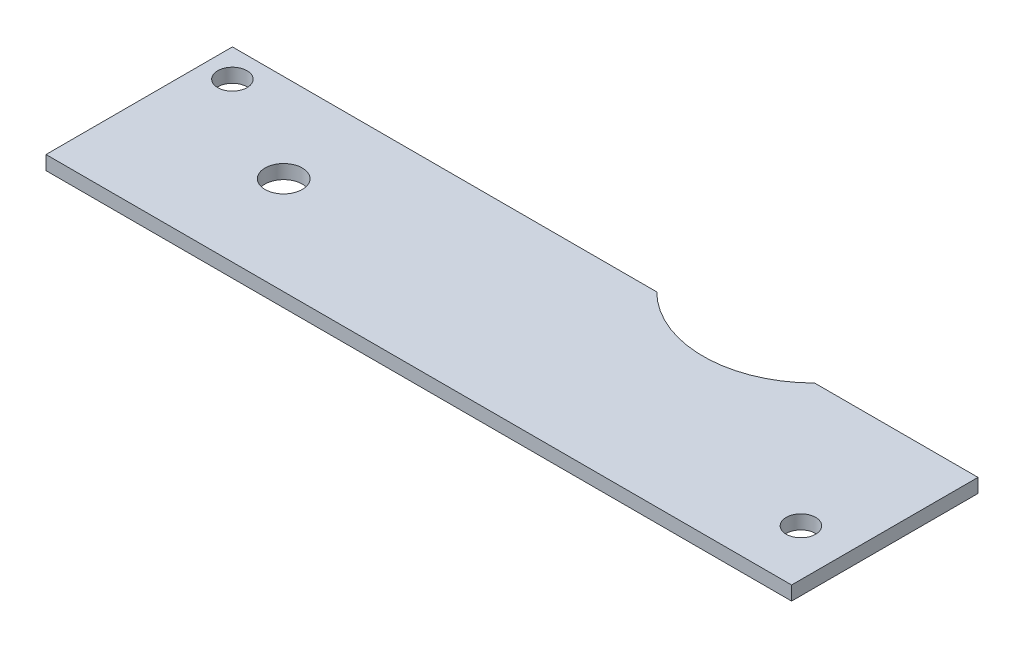
ISO-10303-21;
HEADER;
FILE_DESCRIPTION(('STEP AP214'),'2;1');
FILE_NAME('part.step','',(''),(''),'','','');
FILE_SCHEMA(('AUTOMOTIVE_DESIGN { 1 0 10303 214 1 1 1 1 }'));
ENDSEC;
DATA;
#1=APPLICATION_CONTEXT('core data for automotive mechanical design processes');
#2=APPLICATION_PROTOCOL_DEFINITION('international standard','automotive_design',2000,#1);
#3=PRODUCT_CONTEXT('',#1,'mechanical');
#4=PRODUCT('Part','Part','',(#3));
#5=PRODUCT_RELATED_PRODUCT_CATEGORY('part','',(#4));
#6=PRODUCT_DEFINITION_FORMATION('','',#4);
#7=PRODUCT_DEFINITION_CONTEXT('part definition',#1,'design');
#8=PRODUCT_DEFINITION('design','',#6,#7);
#9=PRODUCT_DEFINITION_SHAPE('','',#8);
#10=(LENGTH_UNIT() NAMED_UNIT(*) SI_UNIT(.MILLI.,.METRE.));
#11=(NAMED_UNIT(*) PLANE_ANGLE_UNIT() SI_UNIT($,.RADIAN.));
#12=(NAMED_UNIT(*) SI_UNIT($,.STERADIAN.) SOLID_ANGLE_UNIT());
#13=UNCERTAINTY_MEASURE_WITH_UNIT(LENGTH_MEASURE(1.E-05),#10,'distance_accuracy_value','');
#14=(GEOMETRIC_REPRESENTATION_CONTEXT(3) GLOBAL_UNCERTAINTY_ASSIGNED_CONTEXT((#13)) GLOBAL_UNIT_ASSIGNED_CONTEXT((#10,
#11,#12)) REPRESENTATION_CONTEXT('',''));
#15=CARTESIAN_POINT('',(0.,0.,0.));
#16=DIRECTION('',(0.,0.,1.));
#17=DIRECTION('',(1.,0.,0.));
#18=AXIS2_PLACEMENT_3D('',#15,#16,#17);
#19=CARTESIAN_POINT('',(-24.2818921995356,1.5,-20.));
#20=DIRECTION('',(0.,0.,-1.));
#21=DIRECTION('',(-1.,0.,0.));
#22=AXIS2_PLACEMENT_3D('',#19,#20,#21);
#23=PLANE('',#22);
#24=DIRECTION('',(1.,0.,0.));
#25=VECTOR('',#24,1.);
#26=CARTESIAN_POINT('',(-24.2818921995356,0.,-20.));
#27=LINE('',#26,#25);
#28=CARTESIAN_POINT('',(0.,0.,-20.));
#29=VERTEX_POINT('',#28);
#30=CARTESIAN_POINT('',(45.5294628269513,0.,-20.));
#31=VERTEX_POINT('',#30);
#32=EDGE_CURVE('E120',#29,#31,#27,.T.);
#33=ORIENTED_EDGE('',*,*,#32,.F.);
#34=DIRECTION('',(0.,-1.,0.));
#35=VECTOR('',#34,1.);
#36=CARTESIAN_POINT('',(0.,1.5,-20.));
#37=LINE('',#36,#35);
#38=CARTESIAN_POINT('',(0.,1.5,-20.));
#39=VERTEX_POINT('',#38);
#40=EDGE_CURVE('E11',#39,#29,#37,.T.);
#41=ORIENTED_EDGE('',*,*,#40,.F.);
#42=DIRECTION('',(1.,0.,0.));
#43=VECTOR('',#42,1.);
#44=CARTESIAN_POINT('',(-24.2818921995356,1.5,-20.));
#45=LINE('',#44,#43);
#46=CARTESIAN_POINT('',(45.5294628269513,1.5,-20.));
#47=VERTEX_POINT('',#46);
#48=EDGE_CURVE('E136',#39,#47,#45,.T.);
#49=ORIENTED_EDGE('',*,*,#48,.T.);
#50=DIRECTION('',(0.,-1.,0.));
#51=VECTOR('',#50,1.);
#52=CARTESIAN_POINT('',(45.5294628269513,1.5,-20.));
#53=LINE('',#52,#51);
#54=EDGE_CURVE('E78',#47,#31,#53,.T.);
#55=ORIENTED_EDGE('',*,*,#54,.T.);
#56=EDGE_LOOP('',(#33,#41,#49,#55));
#57=FACE_BOUND('',#56,.T.);
#58=ADVANCED_FACE('F33',(#57),#23,.T.);
#59=CARTESIAN_POINT('',(0.,1.5,-9.99999999999999));
#60=DIRECTION('',(-1.,0.,0.));
#61=DIRECTION('',(0.,0.,1.));
#62=AXIS2_PLACEMENT_3D('',#59,#60,#61);
#63=PLANE('',#62);
#64=DIRECTION('',(0.,0.,-1.));
#65=VECTOR('',#64,1.);
#66=CARTESIAN_POINT('',(0.,0.,-9.99999999999999));
#67=LINE('',#66,#65);
#68=CARTESIAN_POINT('',(0.,0.,0.));
#69=VERTEX_POINT('',#68);
#70=EDGE_CURVE('E123',#69,#29,#67,.T.);
#71=ORIENTED_EDGE('',*,*,#70,.F.);
#72=DIRECTION('',(0.,-1.,0.));
#73=VECTOR('',#72,1.);
#74=CARTESIAN_POINT('',(0.,1.5,0.));
#75=LINE('',#74,#73);
#76=CARTESIAN_POINT('',(0.,1.5,0.));
#77=VERTEX_POINT('',#76);
#78=EDGE_CURVE('E42',#77,#69,#75,.T.);
#79=ORIENTED_EDGE('',*,*,#78,.F.);
#80=DIRECTION('',(0.,0.,-1.));
#81=VECTOR('',#80,1.);
#82=CARTESIAN_POINT('',(0.,1.5,-9.99999999999999));
#83=LINE('',#82,#81);
#84=EDGE_CURVE('E150',#77,#39,#83,.T.);
#85=ORIENTED_EDGE('',*,*,#84,.T.);
#86=ORIENTED_EDGE('',*,*,#40,.T.);
#87=EDGE_LOOP('',(#71,#79,#85,#86));
#88=FACE_BOUND('',#87,.T.);
#89=ADVANCED_FACE('F149',(#88),#63,.T.);
#90=CARTESIAN_POINT('',(-24.2818921995356,1.5,0.));
#91=DIRECTION('',(0.,0.,-1.));
#92=DIRECTION('',(-1.,0.,0.));
#93=AXIS2_PLACEMENT_3D('',#90,#91,#92);
#94=PLANE('',#93);
#95=DIRECTION('',(1.,0.,0.));
#96=VECTOR('',#95,1.);
#97=CARTESIAN_POINT('',(-24.2818921995356,0.,0.));
#98=LINE('',#97,#96);
#99=CARTESIAN_POINT('',(80.,0.,0.));
#100=VERTEX_POINT('',#99);
#101=EDGE_CURVE('E126',#69,#100,#98,.T.);
#102=ORIENTED_EDGE('',*,*,#101,.T.);
#103=DIRECTION('',(0.,-1.,0.));
#104=VECTOR('',#103,1.);
#105=CARTESIAN_POINT('',(80.,1.5,0.));
#106=LINE('',#105,#104);
#107=CARTESIAN_POINT('',(80.,1.5,0.));
#108=VERTEX_POINT('',#107);
#109=EDGE_CURVE('E110',#108,#100,#106,.T.);
#110=ORIENTED_EDGE('',*,*,#109,.F.);
#111=DIRECTION('',(1.,0.,0.));
#112=VECTOR('',#111,1.);
#113=CARTESIAN_POINT('',(-24.2818921995356,1.5,0.));
#114=LINE('',#113,#112);
#115=EDGE_CURVE('E97',#77,#108,#114,.T.);
#116=ORIENTED_EDGE('',*,*,#115,.F.);
#117=ORIENTED_EDGE('',*,*,#78,.T.);
#118=EDGE_LOOP('',(#102,#110,#116,#117));
#119=FACE_BOUND('',#118,.T.);
#120=ADVANCED_FACE('F142',(#119),#94,.F.);
#121=CARTESIAN_POINT('',(80.,1.5,-9.99999999999998));
#122=DIRECTION('',(-1.,0.,0.));
#123=DIRECTION('',(0.,0.,1.));
#124=AXIS2_PLACEMENT_3D('',#121,#122,#123);
#125=PLANE('',#124);
#126=DIRECTION('',(0.,0.,-1.));
#127=VECTOR('',#126,1.);
#128=CARTESIAN_POINT('',(80.,0.,-9.99999999999998));
#129=LINE('',#128,#127);
#130=CARTESIAN_POINT('',(80.,0.,-20.));
#131=VERTEX_POINT('',#130);
#132=EDGE_CURVE('E106',#100,#131,#129,.T.);
#133=ORIENTED_EDGE('',*,*,#132,.T.);
#134=DIRECTION('',(0.,-1.,0.));
#135=VECTOR('',#134,1.);
#136=CARTESIAN_POINT('',(80.,1.5,-20.));
#137=LINE('',#136,#135);
#138=CARTESIAN_POINT('',(80.,1.5,-20.));
#139=VERTEX_POINT('',#138);
#140=EDGE_CURVE('E103',#139,#131,#137,.T.);
#141=ORIENTED_EDGE('',*,*,#140,.F.);
#142=DIRECTION('',(0.,0.,-1.));
#143=VECTOR('',#142,1.);
#144=CARTESIAN_POINT('',(80.,1.5,-9.99999999999998));
#145=LINE('',#144,#143);
#146=EDGE_CURVE('E89',#108,#139,#145,.T.);
#147=ORIENTED_EDGE('',*,*,#146,.F.);
#148=ORIENTED_EDGE('',*,*,#109,.T.);
#149=EDGE_LOOP('',(#133,#141,#147,#148));
#150=FACE_BOUND('',#149,.T.);
#151=ADVANCED_FACE('F104',(#150),#125,.F.);
#152=CARTESIAN_POINT('',(-24.2818921995356,1.5,-20.));
#153=DIRECTION('',(0.,0.,-1.));
#154=DIRECTION('',(-1.,0.,0.));
#155=AXIS2_PLACEMENT_3D('',#152,#153,#154);
#156=PLANE('',#155);
#157=DIRECTION('',(1.,0.,0.));
#158=VECTOR('',#157,1.);
#159=CARTESIAN_POINT('',(-24.2818921995356,0.,-20.));
#160=LINE('',#159,#158);
#161=CARTESIAN_POINT('',(62.4705371730487,0.,-20.));
#162=VERTEX_POINT('',#161);
#163=EDGE_CURVE('E129',#162,#131,#160,.T.);
#164=ORIENTED_EDGE('',*,*,#163,.F.);
#165=DIRECTION('',(0.,-1.,0.));
#166=VECTOR('',#165,1.);
#167=CARTESIAN_POINT('',(62.4705371730487,1.5,-20.));
#168=LINE('',#167,#166);
#169=CARTESIAN_POINT('',(62.4705371730487,1.5,-20.));
#170=VERTEX_POINT('',#169);
#171=EDGE_CURVE('E71',#170,#162,#168,.T.);
#172=ORIENTED_EDGE('',*,*,#171,.F.);
#173=DIRECTION('',(1.,0.,0.));
#174=VECTOR('',#173,1.);
#175=CARTESIAN_POINT('',(-24.2818921995356,1.5,-20.));
#176=LINE('',#175,#174);
#177=EDGE_CURVE('E94',#170,#139,#176,.T.);
#178=ORIENTED_EDGE('',*,*,#177,.T.);
#179=ORIENTED_EDGE('',*,*,#140,.T.);
#180=EDGE_LOOP('',(#164,#172,#178,#179));
#181=FACE_BOUND('',#180,.T.);
#182=ADVANCED_FACE('F112',(#181),#156,.T.);
#183=CARTESIAN_POINT('',(54.,1.5,-28.5));
#184=DIRECTION('',(0.,-1.,0.));
#185=DIRECTION('',(0.,0.,-1.));
#186=AXIS2_PLACEMENT_3D('',#183,#184,#185);
#187=CYLINDRICAL_SURFACE('',#186,12.);
#188=CARTESIAN_POINT('',(54.,0.,-28.5));
#189=DIRECTION('',(0.,1.,0.));
#190=DIRECTION('',(0.,0.,1.));
#191=AXIS2_PLACEMENT_3D('',#188,#189,#190);
#192=CIRCLE('',#191,12.);
#193=EDGE_CURVE('E131',#162,#31,#192,.F.);
#194=ORIENTED_EDGE('',*,*,#193,.T.);
#195=ORIENTED_EDGE('',*,*,#54,.F.);
#196=CARTESIAN_POINT('',(54.,1.5,-28.5));
#197=DIRECTION('',(0.,1.,0.));
#198=DIRECTION('',(0.,0.,1.));
#199=AXIS2_PLACEMENT_3D('',#196,#197,#198);
#200=CIRCLE('',#199,12.);
#201=EDGE_CURVE('E50',#170,#47,#200,.F.);
#202=ORIENTED_EDGE('',*,*,#201,.F.);
#203=ORIENTED_EDGE('',*,*,#171,.T.);
#204=EDGE_LOOP('',(#194,#195,#202,#203));
#205=FACE_BOUND('',#204,.T.);
#206=ADVANCED_FACE('F151',(#205),#187,.F.);
#207=CARTESIAN_POINT('',(15.,1.5,-10.5));
#208=DIRECTION('',(0.,-1.,0.));
#209=DIRECTION('',(0.,0.,-1.));
#210=AXIS2_PLACEMENT_3D('',#207,#208,#209);
#211=CYLINDRICAL_SURFACE('',#210,2.);
#212=CARTESIAN_POINT('',(15.,1.5,-10.5));
#213=DIRECTION('',(0.,1.,0.));
#214=DIRECTION('',(0.,0.,1.));
#215=AXIS2_PLACEMENT_3D('',#212,#213,#214);
#216=CIRCLE('',#215,2.);
#217=CARTESIAN_POINT('',(15.,1.5,-8.5));
#218=VERTEX_POINT('',#217);
#219=EDGE_CURVE('E114',#218,#218,#216,.T.);
#220=ORIENTED_EDGE('',*,*,#219,.T.);
#221=EDGE_LOOP('',(#220));
#222=FACE_BOUND('',#221,.T.);
#223=CARTESIAN_POINT('',(15.,0.,-10.5));
#224=DIRECTION('',(0.,1.,0.));
#225=DIRECTION('',(0.,0.,1.));
#226=AXIS2_PLACEMENT_3D('',#223,#224,#225);
#227=CIRCLE('',#226,2.);
#228=CARTESIAN_POINT('',(15.,0.,-8.5));
#229=VERTEX_POINT('',#228);
#230=EDGE_CURVE('E133',#229,#229,#227,.T.);
#231=ORIENTED_EDGE('',*,*,#230,.F.);
#232=EDGE_LOOP('',(#231));
#233=FACE_BOUND('',#232,.T.);
#234=ADVANCED_FACE('F198',(#222,#233),#211,.F.);
#235=CARTESIAN_POINT('',(-24.2818921995356,1.5,-9.99999999999998));
#236=DIRECTION('',(0.,1.,0.));
#237=DIRECTION('',(0.,0.,1.));
#238=AXIS2_PLACEMENT_3D('',#235,#236,#237);
#239=PLANE('',#238);
#240=CARTESIAN_POINT('',(75.,1.5,-6.));
#241=DIRECTION('',(0.,1.,0.));
#242=DIRECTION('',(0.,0.,1.));
#243=AXIS2_PLACEMENT_3D('',#240,#241,#242);
#244=CIRCLE('',#243,1.57499999999999);
#245=CARTESIAN_POINT('',(75.,1.5,-4.42500000000001));
#246=VERTEX_POINT('',#245);
#247=EDGE_CURVE('E158',#246,#246,#244,.T.);
#248=ORIENTED_EDGE('',*,*,#247,.F.);
#249=EDGE_LOOP('',(#248));
#250=FACE_BOUND('',#249,.T.);
#251=CARTESIAN_POINT('',(3.,1.5,-17.));
#252=DIRECTION('',(0.,1.,0.));
#253=DIRECTION('',(0.,0.,1.));
#254=AXIS2_PLACEMENT_3D('',#251,#252,#253);
#255=CIRCLE('',#254,1.57499999999999);
#256=CARTESIAN_POINT('',(3.,1.5,-15.425));
#257=VERTEX_POINT('',#256);
#258=EDGE_CURVE('E36',#257,#257,#255,.T.);
#259=ORIENTED_EDGE('',*,*,#258,.F.);
#260=EDGE_LOOP('',(#259));
#261=FACE_BOUND('',#260,.T.);
#262=ORIENTED_EDGE('',*,*,#48,.F.);
#263=ORIENTED_EDGE('',*,*,#84,.F.);
#264=ORIENTED_EDGE('',*,*,#115,.T.);
#265=ORIENTED_EDGE('',*,*,#146,.T.);
#266=ORIENTED_EDGE('',*,*,#177,.F.);
#267=ORIENTED_EDGE('',*,*,#201,.T.);
#268=EDGE_LOOP('',(#262,#263,#264,#265,#266,#267));
#269=FACE_BOUND('',#268,.T.);
#270=ORIENTED_EDGE('',*,*,#219,.F.);
#271=EDGE_LOOP('',(#270));
#272=FACE_BOUND('',#271,.T.);
#273=ADVANCED_FACE('F91',(#250,#261,#269,#272),#239,.T.);
#274=CARTESIAN_POINT('',(-24.2818921995356,0.,-9.99999999999998));
#275=DIRECTION('',(0.,1.,0.));
#276=DIRECTION('',(0.,0.,1.));
#277=AXIS2_PLACEMENT_3D('',#274,#275,#276);
#278=PLANE('',#277);
#279=CARTESIAN_POINT('',(75.,0.,-6.));
#280=DIRECTION('',(0.,-1.,0.));
#281=DIRECTION('',(0.,0.,-1.));
#282=AXIS2_PLACEMENT_3D('',#279,#280,#281);
#283=CIRCLE('',#282,1.57499999999999);
#284=CARTESIAN_POINT('',(75.,0.,-7.575));
#285=VERTEX_POINT('',#284);
#286=EDGE_CURVE('E161',#285,#285,#283,.T.);
#287=ORIENTED_EDGE('',*,*,#286,.F.);
#288=EDGE_LOOP('',(#287));
#289=FACE_BOUND('',#288,.T.);
#290=CARTESIAN_POINT('',(3.,0.,-17.));
#291=DIRECTION('',(0.,-1.,0.));
#292=DIRECTION('',(0.,0.,-1.));
#293=AXIS2_PLACEMENT_3D('',#290,#291,#292);
#294=CIRCLE('',#293,1.57499999999999);
#295=CARTESIAN_POINT('',(3.,0.,-18.575));
#296=VERTEX_POINT('',#295);
#297=EDGE_CURVE('E155',#296,#296,#294,.T.);
#298=ORIENTED_EDGE('',*,*,#297,.F.);
#299=EDGE_LOOP('',(#298));
#300=FACE_BOUND('',#299,.T.);
#301=ORIENTED_EDGE('',*,*,#32,.T.);
#302=ORIENTED_EDGE('',*,*,#193,.F.);
#303=ORIENTED_EDGE('',*,*,#163,.T.);
#304=ORIENTED_EDGE('',*,*,#132,.F.);
#305=ORIENTED_EDGE('',*,*,#101,.F.);
#306=ORIENTED_EDGE('',*,*,#70,.T.);
#307=EDGE_LOOP('',(#301,#302,#303,#304,#305,#306));
#308=FACE_BOUND('',#307,.T.);
#309=ORIENTED_EDGE('',*,*,#230,.T.);
#310=EDGE_LOOP('',(#309));
#311=FACE_BOUND('',#310,.T.);
#312=ADVANCED_FACE('F147',(#289,#300,#308,#311),#278,.F.);
#313=CARTESIAN_POINT('',(3.,0.,-17.));
#314=DIRECTION('',(0.,-1.,0.));
#315=DIRECTION('',(0.,0.,-1.));
#316=AXIS2_PLACEMENT_3D('',#313,#314,#315);
#317=CYLINDRICAL_SURFACE('',#316,1.57499999999999);
#318=ORIENTED_EDGE('',*,*,#258,.T.);
#319=EDGE_LOOP('',(#318));
#320=FACE_BOUND('',#319,.T.);
#321=ORIENTED_EDGE('',*,*,#297,.T.);
#322=EDGE_LOOP('',(#321));
#323=FACE_BOUND('',#322,.T.);
#324=ADVANCED_FACE('F169',(#320,#323),#317,.F.);
#325=CARTESIAN_POINT('',(75.,0.,-6.));
#326=DIRECTION('',(0.,-1.,0.));
#327=DIRECTION('',(0.,0.,-1.));
#328=AXIS2_PLACEMENT_3D('',#325,#326,#327);
#329=CYLINDRICAL_SURFACE('',#328,1.57499999999999);
#330=ORIENTED_EDGE('',*,*,#247,.T.);
#331=EDGE_LOOP('',(#330));
#332=FACE_BOUND('',#331,.T.);
#333=ORIENTED_EDGE('',*,*,#286,.T.);
#334=EDGE_LOOP('',(#333));
#335=FACE_BOUND('',#334,.T.);
#336=ADVANCED_FACE('F165',(#332,#335),#329,.F.);
#337=CLOSED_SHELL('',(#58,#89,#120,#151,#182,#206,#234,#273,#312,#324,#336));
#338=MANIFOLD_SOLID_BREP('B2',#337);
#339=ADVANCED_BREP_SHAPE_REPRESENTATION('',(#18,#338),#14);
#340=SHAPE_DEFINITION_REPRESENTATION(#9,#339);
ENDSEC;
END-ISO-10303-21;
